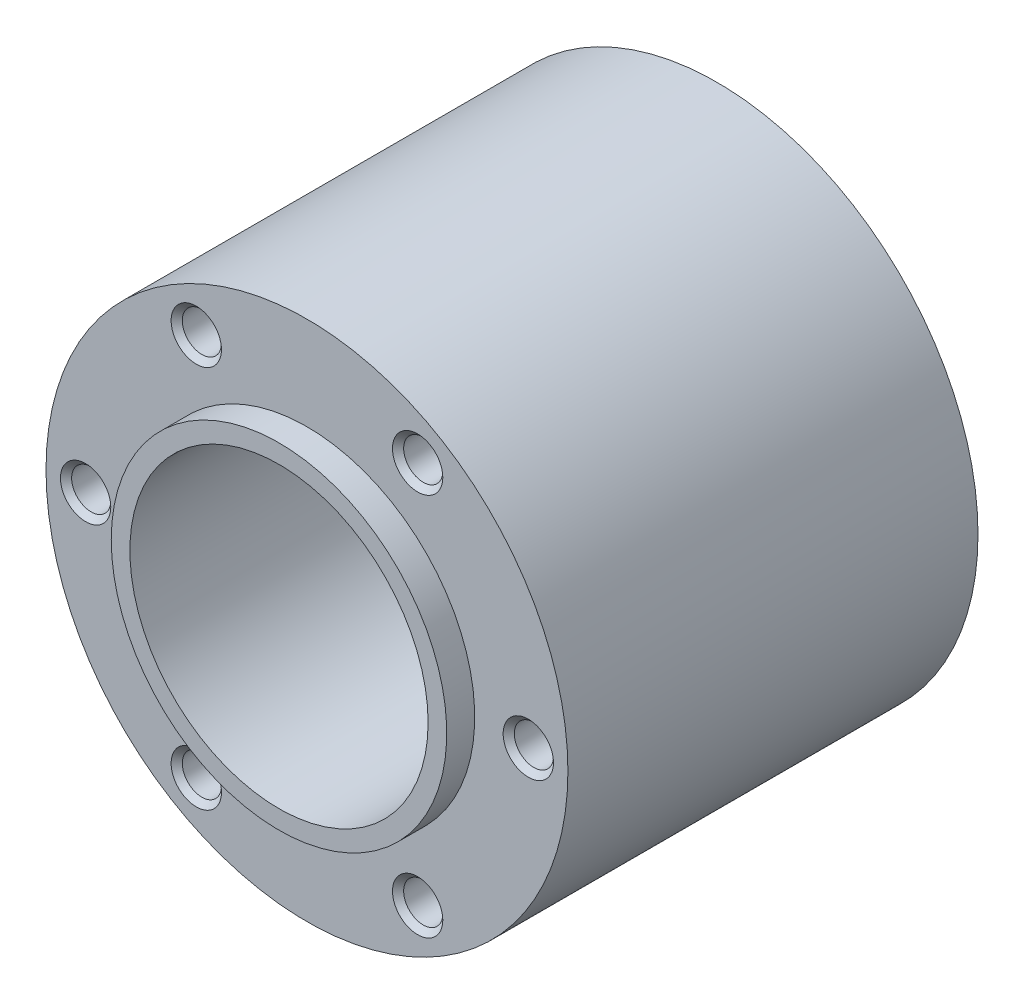
ISO-10303-21;
HEADER;
FILE_DESCRIPTION(('STEP AP214'),'2;1');
FILE_NAME('part.step','',(''),(''),'','','');
FILE_SCHEMA(('AUTOMOTIVE_DESIGN { 1 0 10303 214 1 1 1 1 }'));
ENDSEC;
DATA;
#1=APPLICATION_CONTEXT('core data for automotive mechanical design processes');
#2=APPLICATION_PROTOCOL_DEFINITION('international standard','automotive_design',2000,#1);
#3=PRODUCT_CONTEXT('',#1,'mechanical');
#4=PRODUCT('Part','Part','',(#3));
#5=PRODUCT_RELATED_PRODUCT_CATEGORY('part','',(#4));
#6=PRODUCT_DEFINITION_FORMATION('','',#4);
#7=PRODUCT_DEFINITION_CONTEXT('part definition',#1,'design');
#8=PRODUCT_DEFINITION('design','',#6,#7);
#9=PRODUCT_DEFINITION_SHAPE('','',#8);
#10=(LENGTH_UNIT() NAMED_UNIT(*) SI_UNIT(.MILLI.,.METRE.));
#11=(NAMED_UNIT(*) PLANE_ANGLE_UNIT() SI_UNIT($,.RADIAN.));
#12=(NAMED_UNIT(*) SI_UNIT($,.STERADIAN.) SOLID_ANGLE_UNIT());
#13=UNCERTAINTY_MEASURE_WITH_UNIT(LENGTH_MEASURE(1.E-05),#10,'distance_accuracy_value','');
#14=(GEOMETRIC_REPRESENTATION_CONTEXT(3) GLOBAL_UNCERTAINTY_ASSIGNED_CONTEXT((#13)) GLOBAL_UNIT_ASSIGNED_CONTEXT((#10,
#11,#12)) REPRESENTATION_CONTEXT('',''));
#15=CARTESIAN_POINT('',(0.,0.,0.));
#16=DIRECTION('',(0.,0.,1.));
#17=DIRECTION('',(1.,0.,0.));
#18=AXIS2_PLACEMENT_3D('',#15,#16,#17);
#19=CARTESIAN_POINT('',(0.,0.,0.));
#20=DIRECTION('',(0.,0.,1.));
#21=DIRECTION('',(1.,0.,0.));
#22=AXIS2_PLACEMENT_3D('',#19,#20,#21);
#23=PLANE('',#22);
#24=CARTESIAN_POINT('',(0.,0.,0.));
#25=DIRECTION('',(0.,0.,1.));
#26=DIRECTION('',(1.,0.,0.));
#27=AXIS2_PLACEMENT_3D('',#24,#25,#26);
#28=CIRCLE('',#27,16.);
#29=CARTESIAN_POINT('',(16.,0.,0.));
#30=VERTEX_POINT('',#29);
#31=EDGE_CURVE('E133',#30,#30,#28,.T.);
#32=ORIENTED_EDGE('',*,*,#31,.F.);
#33=EDGE_LOOP('',(#32));
#34=FACE_BOUND('',#33,.T.);
#35=CARTESIAN_POINT('',(0.,0.,0.));
#36=DIRECTION('',(0.,0.,-1.));
#37=DIRECTION('',(-1.,0.,0.));
#38=AXIS2_PLACEMENT_3D('',#35,#36,#37);
#39=CIRCLE('',#38,18.);
#40=CARTESIAN_POINT('',(-18.,0.,0.));
#41=VERTEX_POINT('',#40);
#42=EDGE_CURVE('E115',#41,#41,#39,.T.);
#43=ORIENTED_EDGE('',*,*,#42,.F.);
#44=EDGE_LOOP('',(#43));
#45=FACE_BOUND('',#44,.T.);
#46=ADVANCED_FACE('F35',(#34,#45),#23,.T.);
#47=CARTESIAN_POINT('',(0.,0.,-50.));
#48=DIRECTION('',(0.,0.,-1.));
#49=DIRECTION('',(-1.,0.,0.));
#50=AXIS2_PLACEMENT_3D('',#47,#48,#49);
#51=CYLINDRICAL_SURFACE('',#50,18.);
#52=ORIENTED_EDGE('',*,*,#42,.T.);
#53=EDGE_LOOP('',(#52));
#54=FACE_BOUND('',#53,.T.);
#55=CARTESIAN_POINT('',(0.,0.,-3.));
#56=DIRECTION('',(0.,0.,-1.));
#57=DIRECTION('',(-1.,0.,0.));
#58=AXIS2_PLACEMENT_3D('',#55,#56,#57);
#59=CIRCLE('',#58,18.);
#60=CARTESIAN_POINT('',(-18.,0.,-3.));
#61=VERTEX_POINT('',#60);
#62=EDGE_CURVE('E118',#61,#61,#59,.T.);
#63=ORIENTED_EDGE('',*,*,#62,.F.);
#64=EDGE_LOOP('',(#63));
#65=FACE_BOUND('',#64,.T.);
#66=ADVANCED_FACE('F158',(#54,#65),#51,.T.);
#67=CARTESIAN_POINT('',(-18.,0.,-3.));
#68=DIRECTION('',(0.,0.,1.));
#69=DIRECTION('',(1.,0.,0.));
#70=AXIS2_PLACEMENT_3D('',#67,#68,#69);
#71=PLANE('',#70);
#72=CARTESIAN_POINT('',(23.75,0.,-3.));
#73=DIRECTION('',(0.,0.,1.));
#74=DIRECTION('',(1.,0.,0.));
#75=AXIS2_PLACEMENT_3D('',#72,#73,#74);
#76=CIRCLE('',#75,2.69999999999997);
#77=CARTESIAN_POINT('',(26.45,0.,-3.));
#78=VERTEX_POINT('',#77);
#79=EDGE_CURVE('E73',#78,#78,#76,.F.);
#80=ORIENTED_EDGE('',*,*,#79,.T.);
#81=EDGE_LOOP('',(#80));
#82=FACE_BOUND('',#81,.T.);
#83=CARTESIAN_POINT('',(11.875,-20.5681033398804,-3.));
#84=DIRECTION('',(0.,0.,1.));
#85=DIRECTION('',(1.,0.,0.));
#86=AXIS2_PLACEMENT_3D('',#83,#84,#85);
#87=CIRCLE('',#86,2.69999999999997);
#88=CARTESIAN_POINT('',(14.5749999999999,-20.5681033398804,-3.));
#89=VERTEX_POINT('',#88);
#90=EDGE_CURVE('E76',#89,#89,#87,.F.);
#91=ORIENTED_EDGE('',*,*,#90,.T.);
#92=EDGE_LOOP('',(#91));
#93=FACE_BOUND('',#92,.T.);
#94=CARTESIAN_POINT('',(-11.8750000000001,-20.5681033398804,-3.));
#95=DIRECTION('',(0.,0.,1.));
#96=DIRECTION('',(1.,0.,0.));
#97=AXIS2_PLACEMENT_3D('',#94,#95,#96);
#98=CIRCLE('',#97,2.69999999999997);
#99=CARTESIAN_POINT('',(-9.17500000000013,-20.5681033398804,-3.));
#100=VERTEX_POINT('',#99);
#101=EDGE_CURVE('E79',#100,#100,#98,.F.);
#102=ORIENTED_EDGE('',*,*,#101,.T.);
#103=EDGE_LOOP('',(#102));
#104=FACE_BOUND('',#103,.T.);
#105=CARTESIAN_POINT('',(-23.75,0.,-3.));
#106=DIRECTION('',(0.,0.,1.));
#107=DIRECTION('',(1.,0.,0.));
#108=AXIS2_PLACEMENT_3D('',#105,#106,#107);
#109=CIRCLE('',#108,2.69999999999997);
#110=CARTESIAN_POINT('',(-21.05,0.,-3.));
#111=VERTEX_POINT('',#110);
#112=EDGE_CURVE('E82',#111,#111,#109,.F.);
#113=ORIENTED_EDGE('',*,*,#112,.T.);
#114=EDGE_LOOP('',(#113));
#115=FACE_BOUND('',#114,.T.);
#116=CARTESIAN_POINT('',(-11.8749999999998,20.5681033398805,-3.));
#117=DIRECTION('',(0.,0.,1.));
#118=DIRECTION('',(1.,0.,0.));
#119=AXIS2_PLACEMENT_3D('',#116,#117,#118);
#120=CIRCLE('',#119,2.69999999999997);
#121=CARTESIAN_POINT('',(-9.17499999999984,20.5681033398805,-3.));
#122=VERTEX_POINT('',#121);
#123=EDGE_CURVE('E85',#122,#122,#120,.F.);
#124=ORIENTED_EDGE('',*,*,#123,.T.);
#125=EDGE_LOOP('',(#124));
#126=FACE_BOUND('',#125,.T.);
#127=CARTESIAN_POINT('',(11.8750000000002,20.5681033398803,-3.));
#128=DIRECTION('',(0.,0.,1.));
#129=DIRECTION('',(1.,0.,0.));
#130=AXIS2_PLACEMENT_3D('',#127,#128,#129);
#131=CIRCLE('',#130,2.69999999999997);
#132=CARTESIAN_POINT('',(14.5750000000002,20.5681033398803,-3.));
#133=VERTEX_POINT('',#132);
#134=EDGE_CURVE('E88',#133,#133,#131,.F.);
#135=ORIENTED_EDGE('',*,*,#134,.T.);
#136=EDGE_LOOP('',(#135));
#137=FACE_BOUND('',#136,.T.);
#138=ORIENTED_EDGE('',*,*,#62,.T.);
#139=EDGE_LOOP('',(#138));
#140=FACE_BOUND('',#139,.T.);
#141=CARTESIAN_POINT('',(0.,0.,-3.));
#142=DIRECTION('',(0.,0.,-1.));
#143=DIRECTION('',(-1.,0.,0.));
#144=AXIS2_PLACEMENT_3D('',#141,#142,#143);
#145=CIRCLE('',#144,28.);
#146=CARTESIAN_POINT('',(-28.,0.,-3.));
#147=VERTEX_POINT('',#146);
#148=EDGE_CURVE('E121',#147,#147,#145,.T.);
#149=ORIENTED_EDGE('',*,*,#148,.F.);
#150=EDGE_LOOP('',(#149));
#151=FACE_BOUND('',#150,.T.);
#152=ADVANCED_FACE('F164',(#82,#93,#104,#115,#126,#137,#140,#151),#71,.T.);
#153=CARTESIAN_POINT('',(0.,0.,-50.));
#154=DIRECTION('',(0.,0.,-1.));
#155=DIRECTION('',(-1.,0.,0.));
#156=AXIS2_PLACEMENT_3D('',#153,#154,#155);
#157=CYLINDRICAL_SURFACE('',#156,28.);
#158=ORIENTED_EDGE('',*,*,#148,.T.);
#159=EDGE_LOOP('',(#158));
#160=FACE_BOUND('',#159,.T.);
#161=CARTESIAN_POINT('',(0.,0.,-47.));
#162=DIRECTION('',(0.,0.,-1.));
#163=DIRECTION('',(-1.,0.,0.));
#164=AXIS2_PLACEMENT_3D('',#161,#162,#163);
#165=CIRCLE('',#164,28.);
#166=CARTESIAN_POINT('',(-28.,0.,-47.));
#167=VERTEX_POINT('',#166);
#168=EDGE_CURVE('E124',#167,#167,#165,.T.);
#169=ORIENTED_EDGE('',*,*,#168,.F.);
#170=EDGE_LOOP('',(#169));
#171=FACE_BOUND('',#170,.T.);
#172=ADVANCED_FACE('F224',(#160,#171),#157,.T.);
#173=CARTESIAN_POINT('',(-28.,0.,-47.));
#174=DIRECTION('',(0.,0.,-1.));
#175=DIRECTION('',(-1.,0.,0.));
#176=AXIS2_PLACEMENT_3D('',#173,#174,#175);
#177=PLANE('',#176);
#178=CARTESIAN_POINT('',(23.75,0.,-47.));
#179=DIRECTION('',(0.,0.,-1.));
#180=DIRECTION('',(-1.,0.,0.));
#181=AXIS2_PLACEMENT_3D('',#178,#179,#180);
#182=CIRCLE('',#181,2.69999999999999);
#183=CARTESIAN_POINT('',(21.05,0.,-47.));
#184=VERTEX_POINT('',#183);
#185=EDGE_CURVE('E91',#184,#184,#182,.F.);
#186=ORIENTED_EDGE('',*,*,#185,.T.);
#187=EDGE_LOOP('',(#186));
#188=FACE_BOUND('',#187,.T.);
#189=CARTESIAN_POINT('',(11.875,-20.5681033398804,-47.));
#190=DIRECTION('',(0.,0.,-1.));
#191=DIRECTION('',(-1.,0.,0.));
#192=AXIS2_PLACEMENT_3D('',#189,#190,#191);
#193=CIRCLE('',#192,2.69999999999999);
#194=CARTESIAN_POINT('',(9.17499999999996,-20.5681033398804,-47.));
#195=VERTEX_POINT('',#194);
#196=EDGE_CURVE('E94',#195,#195,#193,.F.);
#197=ORIENTED_EDGE('',*,*,#196,.T.);
#198=EDGE_LOOP('',(#197));
#199=FACE_BOUND('',#198,.T.);
#200=CARTESIAN_POINT('',(-11.8750000000001,-20.5681033398804,-47.));
#201=DIRECTION('',(0.,0.,-1.));
#202=DIRECTION('',(-1.,0.,0.));
#203=AXIS2_PLACEMENT_3D('',#200,#201,#202);
#204=CIRCLE('',#203,2.69999999999999);
#205=CARTESIAN_POINT('',(-14.5750000000001,-20.5681033398804,-47.));
#206=VERTEX_POINT('',#205);
#207=EDGE_CURVE('E97',#206,#206,#204,.F.);
#208=ORIENTED_EDGE('',*,*,#207,.T.);
#209=EDGE_LOOP('',(#208));
#210=FACE_BOUND('',#209,.T.);
#211=CARTESIAN_POINT('',(-23.75,0.,-47.));
#212=DIRECTION('',(0.,0.,-1.));
#213=DIRECTION('',(-1.,0.,0.));
#214=AXIS2_PLACEMENT_3D('',#211,#212,#213);
#215=CIRCLE('',#214,2.69999999999999);
#216=CARTESIAN_POINT('',(-26.45,0.,-47.));
#217=VERTEX_POINT('',#216);
#218=EDGE_CURVE('E100',#217,#217,#215,.F.);
#219=ORIENTED_EDGE('',*,*,#218,.T.);
#220=EDGE_LOOP('',(#219));
#221=FACE_BOUND('',#220,.T.);
#222=CARTESIAN_POINT('',(-11.8749999999998,20.5681033398805,-47.));
#223=DIRECTION('',(0.,0.,-1.));
#224=DIRECTION('',(-1.,0.,0.));
#225=AXIS2_PLACEMENT_3D('',#222,#223,#224);
#226=CIRCLE('',#225,2.69999999999999);
#227=CARTESIAN_POINT('',(-14.5749999999998,20.5681033398805,-47.));
#228=VERTEX_POINT('',#227);
#229=EDGE_CURVE('E103',#228,#228,#226,.F.);
#230=ORIENTED_EDGE('',*,*,#229,.T.);
#231=EDGE_LOOP('',(#230));
#232=FACE_BOUND('',#231,.T.);
#233=CARTESIAN_POINT('',(11.8750000000002,20.5681033398803,-47.));
#234=DIRECTION('',(0.,0.,-1.));
#235=DIRECTION('',(-1.,0.,0.));
#236=AXIS2_PLACEMENT_3D('',#233,#234,#235);
#237=CIRCLE('',#236,2.69999999999999);
#238=CARTESIAN_POINT('',(9.17500000000025,20.5681033398803,-47.));
#239=VERTEX_POINT('',#238);
#240=EDGE_CURVE('E106',#239,#239,#237,.F.);
#241=ORIENTED_EDGE('',*,*,#240,.T.);
#242=EDGE_LOOP('',(#241));
#243=FACE_BOUND('',#242,.T.);
#244=ORIENTED_EDGE('',*,*,#168,.T.);
#245=EDGE_LOOP('',(#244));
#246=FACE_BOUND('',#245,.T.);
#247=CARTESIAN_POINT('',(0.,0.,-47.));
#248=DIRECTION('',(0.,0.,-1.));
#249=DIRECTION('',(-1.,0.,0.));
#250=AXIS2_PLACEMENT_3D('',#247,#248,#249);
#251=CIRCLE('',#250,18.);
#252=CARTESIAN_POINT('',(-18.,0.,-47.));
#253=VERTEX_POINT('',#252);
#254=EDGE_CURVE('E127',#253,#253,#251,.T.);
#255=ORIENTED_EDGE('',*,*,#254,.F.);
#256=EDGE_LOOP('',(#255));
#257=FACE_BOUND('',#256,.T.);
#258=ADVANCED_FACE('F221',(#188,#199,#210,#221,#232,#243,#246,#257),#177,.T.);
#259=CARTESIAN_POINT('',(0.,0.,-50.));
#260=DIRECTION('',(0.,0.,-1.));
#261=DIRECTION('',(-1.,0.,0.));
#262=AXIS2_PLACEMENT_3D('',#259,#260,#261);
#263=CYLINDRICAL_SURFACE('',#262,18.);
#264=ORIENTED_EDGE('',*,*,#254,.T.);
#265=EDGE_LOOP('',(#264));
#266=FACE_BOUND('',#265,.T.);
#267=CARTESIAN_POINT('',(0.,0.,-50.));
#268=DIRECTION('',(0.,0.,-1.));
#269=DIRECTION('',(-1.,0.,0.));
#270=AXIS2_PLACEMENT_3D('',#267,#268,#269);
#271=CIRCLE('',#270,18.);
#272=CARTESIAN_POINT('',(-18.,0.,-50.));
#273=VERTEX_POINT('',#272);
#274=EDGE_CURVE('E130',#273,#273,#271,.T.);
#275=ORIENTED_EDGE('',*,*,#274,.F.);
#276=EDGE_LOOP('',(#275));
#277=FACE_BOUND('',#276,.T.);
#278=ADVANCED_FACE('F155',(#266,#277),#263,.T.);
#279=CARTESIAN_POINT('',(-18.,0.,-50.));
#280=DIRECTION('',(0.,0.,-1.));
#281=DIRECTION('',(-1.,0.,0.));
#282=AXIS2_PLACEMENT_3D('',#279,#280,#281);
#283=PLANE('',#282);
#284=CARTESIAN_POINT('',(0.,0.,-50.));
#285=DIRECTION('',(0.,0.,1.));
#286=DIRECTION('',(1.,0.,0.));
#287=AXIS2_PLACEMENT_3D('',#284,#285,#286);
#288=CIRCLE('',#287,16.);
#289=CARTESIAN_POINT('',(16.,0.,-50.));
#290=VERTEX_POINT('',#289);
#291=EDGE_CURVE('E136',#290,#290,#288,.T.);
#292=ORIENTED_EDGE('',*,*,#291,.T.);
#293=EDGE_LOOP('',(#292));
#294=FACE_BOUND('',#293,.T.);
#295=ORIENTED_EDGE('',*,*,#274,.T.);
#296=EDGE_LOOP('',(#295));
#297=FACE_BOUND('',#296,.T.);
#298=ADVANCED_FACE('F140',(#294,#297),#283,.T.);
#299=CARTESIAN_POINT('',(0.,0.,-50.));
#300=DIRECTION('',(0.,0.,1.));
#301=DIRECTION('',(1.,0.,0.));
#302=AXIS2_PLACEMENT_3D('',#299,#300,#301);
#303=CYLINDRICAL_SURFACE('',#302,16.);
#304=ORIENTED_EDGE('',*,*,#31,.T.);
#305=EDGE_LOOP('',(#304));
#306=FACE_BOUND('',#305,.T.);
#307=ORIENTED_EDGE('',*,*,#291,.F.);
#308=EDGE_LOOP('',(#307));
#309=FACE_BOUND('',#308,.T.);
#310=ADVANCED_FACE('F143',(#306,#309),#303,.F.);
#311=CARTESIAN_POINT('',(23.75,0.,-2.99999999999999));
#312=DIRECTION('',(0.,0.,1.));
#313=DIRECTION('',(1.,0.,0.));
#314=AXIS2_PLACEMENT_3D('',#311,#312,#313);
#315=CYLINDRICAL_SURFACE('',#314,2.09999999999999);
#316=CARTESIAN_POINT('',(23.75,0.,-46.4));
#317=DIRECTION('',(0.,0.,-1.));
#318=DIRECTION('',(-1.,0.,0.));
#319=AXIS2_PLACEMENT_3D('',#316,#317,#318);
#320=CIRCLE('',#319,2.09999999999999);
#321=CARTESIAN_POINT('',(21.65,0.,-46.4));
#322=VERTEX_POINT('',#321);
#323=EDGE_CURVE('E109',#322,#322,#320,.T.);
#324=ORIENTED_EDGE('',*,*,#323,.T.);
#325=EDGE_LOOP('',(#324));
#326=FACE_BOUND('',#325,.T.);
#327=CARTESIAN_POINT('',(23.75,0.,-3.59999999999998));
#328=DIRECTION('',(0.,0.,1.));
#329=DIRECTION('',(1.,0.,0.));
#330=AXIS2_PLACEMENT_3D('',#327,#328,#329);
#331=CIRCLE('',#330,2.09999999999999);
#332=CARTESIAN_POINT('',(25.85,0.,-3.59999999999998));
#333=VERTEX_POINT('',#332);
#334=EDGE_CURVE('E112',#333,#333,#331,.T.);
#335=ORIENTED_EDGE('',*,*,#334,.T.);
#336=EDGE_LOOP('',(#335));
#337=FACE_BOUND('',#336,.T.);
#338=ADVANCED_FACE('F145',(#326,#337),#315,.F.);
#339=CARTESIAN_POINT('',(11.875,-20.5681033398804,-2.99999999999999));
#340=DIRECTION('',(0.,0.,1.));
#341=DIRECTION('',(1.,0.,0.));
#342=AXIS2_PLACEMENT_3D('',#339,#340,#341);
#343=CYLINDRICAL_SURFACE('',#342,2.09999999999999);
#344=CARTESIAN_POINT('',(11.875,-20.5681033398804,-46.4));
#345=DIRECTION('',(0.,0.,-1.));
#346=DIRECTION('',(-1.,0.,0.));
#347=AXIS2_PLACEMENT_3D('',#344,#345,#346);
#348=CIRCLE('',#347,2.09999999999999);
#349=CARTESIAN_POINT('',(9.77499999999996,-20.5681033398804,-46.4));
#350=VERTEX_POINT('',#349);
#351=EDGE_CURVE('E67',#350,#350,#348,.T.);
#352=ORIENTED_EDGE('',*,*,#351,.T.);
#353=EDGE_LOOP('',(#352));
#354=FACE_BOUND('',#353,.T.);
#355=CARTESIAN_POINT('',(11.875,-20.5681033398804,-3.59999999999998));
#356=DIRECTION('',(0.,0.,1.));
#357=DIRECTION('',(1.,0.,0.));
#358=AXIS2_PLACEMENT_3D('',#355,#356,#357);
#359=CIRCLE('',#358,2.09999999999999);
#360=CARTESIAN_POINT('',(13.9749999999999,-20.5681033398804,-3.59999999999998));
#361=VERTEX_POINT('',#360);
#362=EDGE_CURVE('E70',#361,#361,#359,.T.);
#363=ORIENTED_EDGE('',*,*,#362,.T.);
#364=EDGE_LOOP('',(#363));
#365=FACE_BOUND('',#364,.T.);
#366=ADVANCED_FACE('F152',(#354,#365),#343,.F.);
#367=CARTESIAN_POINT('',(-11.8750000000001,-20.5681033398804,-2.99999999999999));
#368=DIRECTION('',(0.,0.,1.));
#369=DIRECTION('',(1.,0.,0.));
#370=AXIS2_PLACEMENT_3D('',#367,#368,#369);
#371=CYLINDRICAL_SURFACE('',#370,2.09999999999999);
#372=CARTESIAN_POINT('',(-11.8750000000001,-20.5681033398804,-46.4));
#373=DIRECTION('',(0.,0.,-1.));
#374=DIRECTION('',(-1.,0.,0.));
#375=AXIS2_PLACEMENT_3D('',#372,#373,#374);
#376=CIRCLE('',#375,2.09999999999999);
#377=CARTESIAN_POINT('',(-13.9750000000001,-20.5681033398804,-46.4));
#378=VERTEX_POINT('',#377);
#379=EDGE_CURVE('E61',#378,#378,#376,.T.);
#380=ORIENTED_EDGE('',*,*,#379,.T.);
#381=EDGE_LOOP('',(#380));
#382=FACE_BOUND('',#381,.T.);
#383=CARTESIAN_POINT('',(-11.8750000000001,-20.5681033398804,-3.59999999999998));
#384=DIRECTION('',(0.,0.,1.));
#385=DIRECTION('',(1.,0.,0.));
#386=AXIS2_PLACEMENT_3D('',#383,#384,#385);
#387=CIRCLE('',#386,2.09999999999999);
#388=CARTESIAN_POINT('',(-9.77500000000011,-20.5681033398804,-3.59999999999998));
#389=VERTEX_POINT('',#388);
#390=EDGE_CURVE('E64',#389,#389,#387,.T.);
#391=ORIENTED_EDGE('',*,*,#390,.T.);
#392=EDGE_LOOP('',(#391));
#393=FACE_BOUND('',#392,.T.);
#394=ADVANCED_FACE('F275',(#382,#393),#371,.F.);
#395=CARTESIAN_POINT('',(-23.75,0.,-2.99999999999999));
#396=DIRECTION('',(0.,0.,1.));
#397=DIRECTION('',(1.,0.,0.));
#398=AXIS2_PLACEMENT_3D('',#395,#396,#397);
#399=CYLINDRICAL_SURFACE('',#398,2.09999999999999);
#400=CARTESIAN_POINT('',(-23.75,0.,-46.4));
#401=DIRECTION('',(0.,0.,-1.));
#402=DIRECTION('',(-1.,0.,0.));
#403=AXIS2_PLACEMENT_3D('',#400,#401,#402);
#404=CIRCLE('',#403,2.09999999999999);
#405=CARTESIAN_POINT('',(-25.85,0.,-46.4));
#406=VERTEX_POINT('',#405);
#407=EDGE_CURVE('E55',#406,#406,#404,.T.);
#408=ORIENTED_EDGE('',*,*,#407,.T.);
#409=EDGE_LOOP('',(#408));
#410=FACE_BOUND('',#409,.T.);
#411=CARTESIAN_POINT('',(-23.75,0.,-3.59999999999998));
#412=DIRECTION('',(0.,0.,1.));
#413=DIRECTION('',(1.,0.,0.));
#414=AXIS2_PLACEMENT_3D('',#411,#412,#413);
#415=CIRCLE('',#414,2.09999999999999);
#416=CARTESIAN_POINT('',(-21.65,0.,-3.59999999999998));
#417=VERTEX_POINT('',#416);
#418=EDGE_CURVE('E58',#417,#417,#415,.T.);
#419=ORIENTED_EDGE('',*,*,#418,.T.);
#420=EDGE_LOOP('',(#419));
#421=FACE_BOUND('',#420,.T.);
#422=ADVANCED_FACE('F267',(#410,#421),#399,.F.);
#423=CARTESIAN_POINT('',(-11.8749999999998,20.5681033398805,-2.99999999999999));
#424=DIRECTION('',(0.,0.,1.));
#425=DIRECTION('',(1.,0.,0.));
#426=AXIS2_PLACEMENT_3D('',#423,#424,#425);
#427=CYLINDRICAL_SURFACE('',#426,2.09999999999999);
#428=CARTESIAN_POINT('',(-11.8749999999998,20.5681033398805,-46.4));
#429=DIRECTION('',(0.,0.,-1.));
#430=DIRECTION('',(-1.,0.,0.));
#431=AXIS2_PLACEMENT_3D('',#428,#429,#430);
#432=CIRCLE('',#431,2.09999999999999);
#433=CARTESIAN_POINT('',(-13.9749999999998,20.5681033398805,-46.4));
#434=VERTEX_POINT('',#433);
#435=EDGE_CURVE('E46',#434,#434,#432,.T.);
#436=ORIENTED_EDGE('',*,*,#435,.T.);
#437=EDGE_LOOP('',(#436));
#438=FACE_BOUND('',#437,.T.);
#439=CARTESIAN_POINT('',(-11.8749999999998,20.5681033398805,-3.59999999999998));
#440=DIRECTION('',(0.,0.,1.));
#441=DIRECTION('',(1.,0.,0.));
#442=AXIS2_PLACEMENT_3D('',#439,#440,#441);
#443=CIRCLE('',#442,2.09999999999999);
#444=CARTESIAN_POINT('',(-9.77499999999982,20.5681033398805,-3.59999999999998));
#445=VERTEX_POINT('',#444);
#446=EDGE_CURVE('E50',#445,#445,#443,.T.);
#447=ORIENTED_EDGE('',*,*,#446,.T.);
#448=EDGE_LOOP('',(#447));
#449=FACE_BOUND('',#448,.T.);
#450=ADVANCED_FACE('F265',(#438,#449),#427,.F.);
#451=CARTESIAN_POINT('',(11.8750000000002,20.5681033398803,-2.99999999999999));
#452=DIRECTION('',(0.,0.,1.));
#453=DIRECTION('',(1.,0.,0.));
#454=AXIS2_PLACEMENT_3D('',#451,#452,#453);
#455=CYLINDRICAL_SURFACE('',#454,2.09999999999999);
#456=CARTESIAN_POINT('',(11.8750000000002,20.5681033398803,-46.4));
#457=DIRECTION('',(0.,0.,-1.));
#458=DIRECTION('',(-1.,0.,0.));
#459=AXIS2_PLACEMENT_3D('',#456,#457,#458);
#460=CIRCLE('',#459,2.09999999999999);
#461=CARTESIAN_POINT('',(9.77500000000025,20.5681033398803,-46.4));
#462=VERTEX_POINT('',#461);
#463=EDGE_CURVE('E10',#462,#462,#460,.T.);
#464=ORIENTED_EDGE('',*,*,#463,.T.);
#465=EDGE_LOOP('',(#464));
#466=FACE_BOUND('',#465,.T.);
#467=CARTESIAN_POINT('',(11.8750000000002,20.5681033398803,-3.59999999999998));
#468=DIRECTION('',(0.,0.,1.));
#469=DIRECTION('',(1.,0.,0.));
#470=AXIS2_PLACEMENT_3D('',#467,#468,#469);
#471=CIRCLE('',#470,2.09999999999999);
#472=CARTESIAN_POINT('',(13.9750000000002,20.5681033398803,-3.59999999999998));
#473=VERTEX_POINT('',#472);
#474=EDGE_CURVE('E42',#473,#473,#471,.T.);
#475=ORIENTED_EDGE('',*,*,#474,.T.);
#476=EDGE_LOOP('',(#475));
#477=FACE_BOUND('',#476,.T.);
#478=ADVANCED_FACE('F175',(#466,#477),#455,.F.);
#479=CARTESIAN_POINT('',(23.75,0.,-46.4));
#480=DIRECTION('',(0.,0.,-1.));
#481=DIRECTION('',(-1.,0.,0.));
#482=AXIS2_PLACEMENT_3D('',#479,#480,#481);
#483=CONICAL_SURFACE('',#482,2.09999999999999,0.785398163397453);
#484=ORIENTED_EDGE('',*,*,#185,.F.);
#485=EDGE_LOOP('',(#484));
#486=FACE_BOUND('',#485,.T.);
#487=ORIENTED_EDGE('',*,*,#323,.F.);
#488=EDGE_LOOP('',(#487));
#489=FACE_BOUND('',#488,.T.);
#490=ADVANCED_FACE('F171',(#486,#489),#483,.F.);
#491=CARTESIAN_POINT('',(23.75,0.,-3.59999999999998));
#492=DIRECTION('',(0.,0.,1.));
#493=DIRECTION('',(1.,0.,0.));
#494=AXIS2_PLACEMENT_3D('',#491,#492,#493);
#495=CONICAL_SURFACE('',#494,2.09999999999999,0.785398163397442);
#496=ORIENTED_EDGE('',*,*,#79,.F.);
#497=EDGE_LOOP('',(#496));
#498=FACE_BOUND('',#497,.T.);
#499=ORIENTED_EDGE('',*,*,#334,.F.);
#500=EDGE_LOOP('',(#499));
#501=FACE_BOUND('',#500,.T.);
#502=ADVANCED_FACE('F174',(#498,#501),#495,.F.);
#503=CARTESIAN_POINT('',(11.875,-20.5681033398804,-46.4));
#504=DIRECTION('',(0.,0.,-1.));
#505=DIRECTION('',(-1.,0.,0.));
#506=AXIS2_PLACEMENT_3D('',#503,#504,#505);
#507=CONICAL_SURFACE('',#506,2.09999999999999,0.785398163397453);
#508=ORIENTED_EDGE('',*,*,#196,.F.);
#509=EDGE_LOOP('',(#508));
#510=FACE_BOUND('',#509,.T.);
#511=ORIENTED_EDGE('',*,*,#351,.F.);
#512=EDGE_LOOP('',(#511));
#513=FACE_BOUND('',#512,.T.);
#514=ADVANCED_FACE('F179',(#510,#513),#507,.F.);
#515=CARTESIAN_POINT('',(11.875,-20.5681033398804,-3.59999999999998));
#516=DIRECTION('',(0.,0.,1.));
#517=DIRECTION('',(1.,0.,0.));
#518=AXIS2_PLACEMENT_3D('',#515,#516,#517);
#519=CONICAL_SURFACE('',#518,2.09999999999999,0.785398163397442);
#520=ORIENTED_EDGE('',*,*,#90,.F.);
#521=EDGE_LOOP('',(#520));
#522=FACE_BOUND('',#521,.T.);
#523=ORIENTED_EDGE('',*,*,#362,.F.);
#524=EDGE_LOOP('',(#523));
#525=FACE_BOUND('',#524,.T.);
#526=ADVANCED_FACE('F183',(#522,#525),#519,.F.);
#527=CARTESIAN_POINT('',(-11.8750000000001,-20.5681033398804,-46.4));
#528=DIRECTION('',(0.,0.,-1.));
#529=DIRECTION('',(-1.,0.,0.));
#530=AXIS2_PLACEMENT_3D('',#527,#528,#529);
#531=CONICAL_SURFACE('',#530,2.09999999999999,0.785398163397453);
#532=ORIENTED_EDGE('',*,*,#207,.F.);
#533=EDGE_LOOP('',(#532));
#534=FACE_BOUND('',#533,.T.);
#535=ORIENTED_EDGE('',*,*,#379,.F.);
#536=EDGE_LOOP('',(#535));
#537=FACE_BOUND('',#536,.T.);
#538=ADVANCED_FACE('F187',(#534,#537),#531,.F.);
#539=CARTESIAN_POINT('',(-11.8750000000001,-20.5681033398804,-3.59999999999998));
#540=DIRECTION('',(0.,0.,1.));
#541=DIRECTION('',(1.,0.,0.));
#542=AXIS2_PLACEMENT_3D('',#539,#540,#541);
#543=CONICAL_SURFACE('',#542,2.09999999999999,0.785398163397442);
#544=ORIENTED_EDGE('',*,*,#101,.F.);
#545=EDGE_LOOP('',(#544));
#546=FACE_BOUND('',#545,.T.);
#547=ORIENTED_EDGE('',*,*,#390,.F.);
#548=EDGE_LOOP('',(#547));
#549=FACE_BOUND('',#548,.T.);
#550=ADVANCED_FACE('F191',(#546,#549),#543,.F.);
#551=CARTESIAN_POINT('',(-23.75,0.,-46.4));
#552=DIRECTION('',(0.,0.,-1.));
#553=DIRECTION('',(-1.,0.,0.));
#554=AXIS2_PLACEMENT_3D('',#551,#552,#553);
#555=CONICAL_SURFACE('',#554,2.09999999999999,0.785398163397453);
#556=ORIENTED_EDGE('',*,*,#218,.F.);
#557=EDGE_LOOP('',(#556));
#558=FACE_BOUND('',#557,.T.);
#559=ORIENTED_EDGE('',*,*,#407,.F.);
#560=EDGE_LOOP('',(#559));
#561=FACE_BOUND('',#560,.T.);
#562=ADVANCED_FACE('F195',(#558,#561),#555,.F.);
#563=CARTESIAN_POINT('',(-23.75,0.,-3.59999999999998));
#564=DIRECTION('',(0.,0.,1.));
#565=DIRECTION('',(1.,0.,0.));
#566=AXIS2_PLACEMENT_3D('',#563,#564,#565);
#567=CONICAL_SURFACE('',#566,2.09999999999999,0.785398163397442);
#568=ORIENTED_EDGE('',*,*,#112,.F.);
#569=EDGE_LOOP('',(#568));
#570=FACE_BOUND('',#569,.T.);
#571=ORIENTED_EDGE('',*,*,#418,.F.);
#572=EDGE_LOOP('',(#571));
#573=FACE_BOUND('',#572,.T.);
#574=ADVANCED_FACE('F199',(#570,#573),#567,.F.);
#575=CARTESIAN_POINT('',(-11.8749999999998,20.5681033398805,-46.4));
#576=DIRECTION('',(0.,0.,-1.));
#577=DIRECTION('',(-1.,0.,0.));
#578=AXIS2_PLACEMENT_3D('',#575,#576,#577);
#579=CONICAL_SURFACE('',#578,2.09999999999999,0.785398163397453);
#580=ORIENTED_EDGE('',*,*,#229,.F.);
#581=EDGE_LOOP('',(#580));
#582=FACE_BOUND('',#581,.T.);
#583=ORIENTED_EDGE('',*,*,#435,.F.);
#584=EDGE_LOOP('',(#583));
#585=FACE_BOUND('',#584,.T.);
#586=ADVANCED_FACE('F203',(#582,#585),#579,.F.);
#587=CARTESIAN_POINT('',(-11.8749999999998,20.5681033398805,-3.59999999999998));
#588=DIRECTION('',(0.,0.,1.));
#589=DIRECTION('',(1.,0.,0.));
#590=AXIS2_PLACEMENT_3D('',#587,#588,#589);
#591=CONICAL_SURFACE('',#590,2.09999999999999,0.785398163397442);
#592=ORIENTED_EDGE('',*,*,#123,.F.);
#593=EDGE_LOOP('',(#592));
#594=FACE_BOUND('',#593,.T.);
#595=ORIENTED_EDGE('',*,*,#446,.F.);
#596=EDGE_LOOP('',(#595));
#597=FACE_BOUND('',#596,.T.);
#598=ADVANCED_FACE('F207',(#594,#597),#591,.F.);
#599=CARTESIAN_POINT('',(11.8750000000002,20.5681033398803,-46.4));
#600=DIRECTION('',(0.,0.,-1.));
#601=DIRECTION('',(-1.,0.,0.));
#602=AXIS2_PLACEMENT_3D('',#599,#600,#601);
#603=CONICAL_SURFACE('',#602,2.09999999999999,0.785398163397453);
#604=ORIENTED_EDGE('',*,*,#240,.F.);
#605=EDGE_LOOP('',(#604));
#606=FACE_BOUND('',#605,.T.);
#607=ORIENTED_EDGE('',*,*,#463,.F.);
#608=EDGE_LOOP('',(#607));
#609=FACE_BOUND('',#608,.T.);
#610=ADVANCED_FACE('F210',(#606,#609),#603,.F.);
#611=CARTESIAN_POINT('',(11.8750000000002,20.5681033398803,-3.59999999999998));
#612=DIRECTION('',(0.,0.,1.));
#613=DIRECTION('',(1.,0.,0.));
#614=AXIS2_PLACEMENT_3D('',#611,#612,#613);
#615=CONICAL_SURFACE('',#614,2.09999999999999,0.785398163397442);
#616=ORIENTED_EDGE('',*,*,#134,.F.);
#617=EDGE_LOOP('',(#616));
#618=FACE_BOUND('',#617,.T.);
#619=ORIENTED_EDGE('',*,*,#474,.F.);
#620=EDGE_LOOP('',(#619));
#621=FACE_BOUND('',#620,.T.);
#622=ADVANCED_FACE('F37',(#618,#621),#615,.F.);
#623=CLOSED_SHELL('',(#46,#66,#152,#172,#258,#278,#298,#310,#338,#366,#394,#422,#450,#478,#490,
#502,#514,#526,#538,#550,#562,#574,#586,#598,#610,#622));
#624=MANIFOLD_SOLID_BREP('B2',#623);
#625=ADVANCED_BREP_SHAPE_REPRESENTATION('',(#18,#624),#14);
#626=SHAPE_DEFINITION_REPRESENTATION(#9,#625);
ENDSEC;
END-ISO-10303-21;
